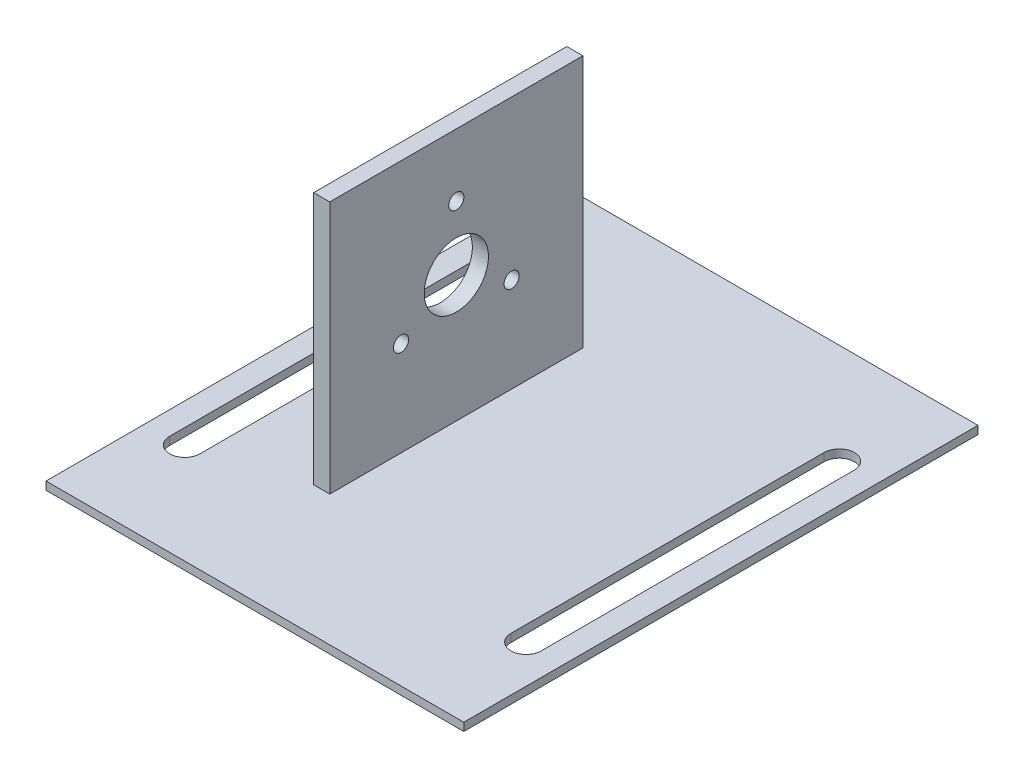
ISO-10303-21;
HEADER;
FILE_DESCRIPTION(('STEP AP214'),'2;1');
FILE_NAME('part.step','',(''),(''),'','','');
FILE_SCHEMA(('AUTOMOTIVE_DESIGN { 1 0 10303 214 1 1 1 1 }'));
ENDSEC;
DATA;
#1=APPLICATION_CONTEXT('core data for automotive mechanical design processes');
#2=APPLICATION_PROTOCOL_DEFINITION('international standard','automotive_design',2000,#1);
#3=PRODUCT_CONTEXT('',#1,'mechanical');
#4=PRODUCT('Part','Part','',(#3));
#5=PRODUCT_RELATED_PRODUCT_CATEGORY('part','',(#4));
#6=PRODUCT_DEFINITION_FORMATION('','',#4);
#7=PRODUCT_DEFINITION_CONTEXT('part definition',#1,'design');
#8=PRODUCT_DEFINITION('design','',#6,#7);
#9=PRODUCT_DEFINITION_SHAPE('','',#8);
#10=(LENGTH_UNIT() NAMED_UNIT(*) SI_UNIT(.MILLI.,.METRE.));
#11=(NAMED_UNIT(*) PLANE_ANGLE_UNIT() SI_UNIT($,.RADIAN.));
#12=(NAMED_UNIT(*) SI_UNIT($,.STERADIAN.) SOLID_ANGLE_UNIT());
#13=UNCERTAINTY_MEASURE_WITH_UNIT(LENGTH_MEASURE(1.E-05),#10,'distance_accuracy_value','');
#14=(GEOMETRIC_REPRESENTATION_CONTEXT(3) GLOBAL_UNCERTAINTY_ASSIGNED_CONTEXT((#13)) GLOBAL_UNIT_ASSIGNED_CONTEXT((#10,
#11,#12)) REPRESENTATION_CONTEXT('',''));
#15=CARTESIAN_POINT('',(0.,0.,0.));
#16=DIRECTION('',(0.,0.,1.));
#17=DIRECTION('',(1.,0.,0.));
#18=AXIS2_PLACEMENT_3D('',#15,#16,#17);
#19=CARTESIAN_POINT('',(0.,3.17500000000009,-203.200000000001));
#20=DIRECTION('',(0.,-1.,0.));
#21=DIRECTION('',(0.,0.,-1.));
#22=AXIS2_PLACEMENT_3D('',#19,#20,#21);
#23=PLANE('',#22);
#24=DIRECTION('',(0.,0.,1.));
#25=VECTOR('',#24,1.);
#26=CARTESIAN_POINT('',(0.,3.175,0.));
#27=LINE('',#26,#25);
#28=CARTESIAN_POINT('',(0.,3.17500000000009,-203.200000000001));
#29=VERTEX_POINT('',#28);
#30=CARTESIAN_POINT('',(0.,3.175,0.));
#31=VERTEX_POINT('',#30);
#32=EDGE_CURVE('E241',#29,#31,#27,.T.);
#33=ORIENTED_EDGE('',*,*,#32,.T.);
#34=DIRECTION('',(1.,0.,0.));
#35=VECTOR('',#34,1.);
#36=CARTESIAN_POINT('',(0.,3.175,0.));
#37=LINE('',#36,#35);
#38=CARTESIAN_POINT('',(165.1,3.17499999999982,0.));
#39=VERTEX_POINT('',#38);
#40=EDGE_CURVE('E244',#31,#39,#37,.T.);
#41=ORIENTED_EDGE('',*,*,#40,.T.);
#42=DIRECTION('',(0.,0.,-1.));
#43=VECTOR('',#42,1.);
#44=CARTESIAN_POINT('',(165.1,3.17499999999982,0.));
#45=LINE('',#44,#43);
#46=CARTESIAN_POINT('',(165.1,3.17499999999991,-203.200000000001));
#47=VERTEX_POINT('',#46);
#48=EDGE_CURVE('E247',#39,#47,#45,.T.);
#49=ORIENTED_EDGE('',*,*,#48,.T.);
#50=DIRECTION('',(-1.,0.,0.));
#51=VECTOR('',#50,1.);
#52=CARTESIAN_POINT('',(0.,3.17500000000009,-203.200000000001));
#53=LINE('',#52,#51);
#54=EDGE_CURVE('E249',#47,#29,#53,.T.);
#55=ORIENTED_EDGE('',*,*,#54,.T.);
#56=EDGE_LOOP('',(#33,#41,#49,#55));
#57=FACE_BOUND('',#56,.T.);
#58=DIRECTION('',(0.,0.,-1.));
#59=VECTOR('',#58,1.);
#60=CARTESIAN_POINT('',(21.113,3.17500000000009,-39.7388543084864));
#61=LINE('',#60,#59);
#62=CARTESIAN_POINT('',(21.113,3.17500000000009,-39.7388543084864));
#63=VERTEX_POINT('',#62);
#64=CARTESIAN_POINT('',(21.113,3.17500000000011,-163.461145691515));
#65=VERTEX_POINT('',#64);
#66=EDGE_CURVE('E224',#63,#65,#61,.T.);
#67=ORIENTED_EDGE('',*,*,#66,.F.);
#68=CARTESIAN_POINT('',(15.113,3.17500000000009,-39.7388543084864));
#69=DIRECTION('',(0.,1.,0.));
#70=DIRECTION('',(0.,0.,1.));
#71=AXIS2_PLACEMENT_3D('',#68,#69,#70);
#72=CIRCLE('',#71,5.99999999999998);
#73=CARTESIAN_POINT('',(9.11300000000007,3.17500000000009,-39.7388543084864));
#74=VERTEX_POINT('',#73);
#75=EDGE_CURVE('E202',#74,#63,#72,.T.);
#76=ORIENTED_EDGE('',*,*,#75,.F.);
#77=DIRECTION('',(0.,0.,1.));
#78=VECTOR('',#77,1.);
#79=CARTESIAN_POINT('',(9.11300000000007,3.17500000000009,-39.7388543084864));
#80=LINE('',#79,#78);
#81=CARTESIAN_POINT('',(9.11300000000004,3.17500000000011,-163.461145691515));
#82=VERTEX_POINT('',#81);
#83=EDGE_CURVE('E213',#82,#74,#80,.T.);
#84=ORIENTED_EDGE('',*,*,#83,.F.);
#85=CARTESIAN_POINT('',(15.113,3.17500000000011,-163.461145691515));
#86=DIRECTION('',(0.,1.,0.));
#87=DIRECTION('',(0.,0.,1.));
#88=AXIS2_PLACEMENT_3D('',#85,#86,#87);
#89=CIRCLE('',#88,5.99999999999998);
#90=EDGE_CURVE('E227',#65,#82,#89,.T.);
#91=ORIENTED_EDGE('',*,*,#90,.F.);
#92=EDGE_LOOP('',(#67,#76,#84,#91));
#93=FACE_BOUND('',#92,.T.);
#94=DIRECTION('',(0.,0.,-1.));
#95=VECTOR('',#94,1.);
#96=CARTESIAN_POINT('',(155.987,3.1749999999999,-39.7388543084864));
#97=LINE('',#96,#95);
#98=CARTESIAN_POINT('',(155.987,3.1749999999999,-39.7388543084864));
#99=VERTEX_POINT('',#98);
#100=CARTESIAN_POINT('',(155.987,3.175,-163.461145691514));
#101=VERTEX_POINT('',#100);
#102=EDGE_CURVE('E173',#99,#101,#97,.T.);
#103=ORIENTED_EDGE('',*,*,#102,.F.);
#104=CARTESIAN_POINT('',(149.987,3.1749999999999,-39.7388543084864));
#105=DIRECTION('',(0.,1.,0.));
#106=DIRECTION('',(0.,0.,1.));
#107=AXIS2_PLACEMENT_3D('',#104,#105,#106);
#108=CIRCLE('',#107,6.00000000000002);
#109=CARTESIAN_POINT('',(143.987,3.1749999999999,-39.7388543084864));
#110=VERTEX_POINT('',#109);
#111=EDGE_CURVE('E171',#110,#99,#108,.T.);
#112=ORIENTED_EDGE('',*,*,#111,.F.);
#113=DIRECTION('',(0.,0.,1.));
#114=VECTOR('',#113,1.);
#115=CARTESIAN_POINT('',(143.987,3.1749999999999,-39.7388543084864));
#116=LINE('',#115,#114);
#117=CARTESIAN_POINT('',(143.987,3.175,-163.461145691514));
#118=VERTEX_POINT('',#117);
#119=EDGE_CURVE('E183',#118,#110,#116,.T.);
#120=ORIENTED_EDGE('',*,*,#119,.F.);
#121=CARTESIAN_POINT('',(149.987,3.175,-163.461145691514));
#122=DIRECTION('',(0.,1.,0.));
#123=DIRECTION('',(0.,0.,1.));
#124=AXIS2_PLACEMENT_3D('',#121,#122,#123);
#125=CIRCLE('',#124,6.00000000000002);
#126=EDGE_CURVE('E195',#101,#118,#125,.T.);
#127=ORIENTED_EDGE('',*,*,#126,.F.);
#128=EDGE_LOOP('',(#103,#112,#120,#127));
#129=FACE_BOUND('',#128,.T.);
#130=DIRECTION('',(0.,0.,-1.));
#131=VECTOR('',#130,1.);
#132=CARTESIAN_POINT('',(60.5496528085068,3.175,-51.6000000000002));
#133=LINE('',#132,#131);
#134=CARTESIAN_POINT('',(60.5496528085068,3.175,-51.6000000000002));
#135=VERTEX_POINT('',#134);
#136=CARTESIAN_POINT('',(60.549652808507,3.175,-151.600000000001));
#137=VERTEX_POINT('',#136);
#138=EDGE_CURVE('E170',#135,#137,#133,.T.);
#139=ORIENTED_EDGE('',*,*,#138,.F.);
#140=DIRECTION('',(1.,0.,0.));
#141=VECTOR('',#140,1.);
#142=CARTESIAN_POINT('',(54.1996528085068,3.175,-51.6000000000002));
#143=LINE('',#142,#141);
#144=CARTESIAN_POINT('',(54.1996528085068,3.175,-51.6000000000002));
#145=VERTEX_POINT('',#144);
#146=EDGE_CURVE('E167',#145,#135,#143,.T.);
#147=ORIENTED_EDGE('',*,*,#146,.F.);
#148=DIRECTION('',(0.,0.,1.));
#149=VECTOR('',#148,1.);
#150=CARTESIAN_POINT('',(54.1996528085068,3.175,-51.6000000000002));
#151=LINE('',#150,#149);
#152=CARTESIAN_POINT('',(54.199652808507,3.175,-151.600000000001));
#153=VERTEX_POINT('',#152);
#154=EDGE_CURVE('E57',#153,#145,#151,.T.);
#155=ORIENTED_EDGE('',*,*,#154,.F.);
#156=DIRECTION('',(-1.,0.,0.));
#157=VECTOR('',#156,1.);
#158=CARTESIAN_POINT('',(54.199652808507,3.175,-151.600000000001));
#159=LINE('',#158,#157);
#160=EDGE_CURVE('E52',#137,#153,#159,.T.);
#161=ORIENTED_EDGE('',*,*,#160,.F.);
#162=EDGE_LOOP('',(#139,#147,#155,#161));
#163=FACE_BOUND('',#162,.T.);
#164=ADVANCED_FACE('F35',(#57,#93,#129,#163),#23,.F.);
#165=CARTESIAN_POINT('',(0.,3.175,0.));
#166=DIRECTION('',(1.,0.,0.));
#167=DIRECTION('',(0.,0.,-1.));
#168=AXIS2_PLACEMENT_3D('',#165,#166,#167);
#169=PLANE('',#168);
#170=DIRECTION('',(0.,0.,1.));
#171=VECTOR('',#170,1.);
#172=CARTESIAN_POINT('',(0.,0.,0.));
#173=LINE('',#172,#171);
#174=CARTESIAN_POINT('',(0.,0.,-203.200000000001));
#175=VERTEX_POINT('',#174);
#176=CARTESIAN_POINT('',(0.,0.,0.));
#177=VERTEX_POINT('',#176);
#178=EDGE_CURVE('E234',#175,#177,#173,.T.);
#179=ORIENTED_EDGE('',*,*,#178,.T.);
#180=DIRECTION('',(0.,-1.,0.));
#181=VECTOR('',#180,1.);
#182=CARTESIAN_POINT('',(0.,3.175,0.));
#183=LINE('',#182,#181);
#184=EDGE_CURVE('E11',#31,#177,#183,.T.);
#185=ORIENTED_EDGE('',*,*,#184,.F.);
#186=ORIENTED_EDGE('',*,*,#32,.F.);
#187=DIRECTION('',(0.,-1.,0.));
#188=VECTOR('',#187,1.);
#189=CARTESIAN_POINT('',(0.,3.17500000000009,-203.200000000001));
#190=LINE('',#189,#188);
#191=EDGE_CURVE('E251',#29,#175,#190,.T.);
#192=ORIENTED_EDGE('',*,*,#191,.T.);
#193=EDGE_LOOP('',(#179,#185,#186,#192));
#194=FACE_BOUND('',#193,.T.);
#195=ADVANCED_FACE('F37',(#194),#169,.F.);
#196=CARTESIAN_POINT('',(0.,3.175,0.));
#197=DIRECTION('',(0.,0.,-1.));
#198=DIRECTION('',(-1.,0.,0.));
#199=AXIS2_PLACEMENT_3D('',#196,#197,#198);
#200=PLANE('',#199);
#201=DIRECTION('',(1.,0.,0.));
#202=VECTOR('',#201,1.);
#203=CARTESIAN_POINT('',(0.,0.,0.));
#204=LINE('',#203,#202);
#205=CARTESIAN_POINT('',(165.1,-1.94289029309402E-13,0.));
#206=VERTEX_POINT('',#205);
#207=EDGE_CURVE('E254',#177,#206,#204,.T.);
#208=ORIENTED_EDGE('',*,*,#207,.T.);
#209=DIRECTION('',(0.,-1.,0.));
#210=VECTOR('',#209,1.);
#211=CARTESIAN_POINT('',(165.1,3.17499999999982,0.));
#212=LINE('',#211,#210);
#213=EDGE_CURVE('E44',#39,#206,#212,.T.);
#214=ORIENTED_EDGE('',*,*,#213,.F.);
#215=ORIENTED_EDGE('',*,*,#40,.F.);
#216=ORIENTED_EDGE('',*,*,#184,.T.);
#217=EDGE_LOOP('',(#208,#214,#215,#216));
#218=FACE_BOUND('',#217,.T.);
#219=ADVANCED_FACE('F319',(#218),#200,.F.);
#220=CARTESIAN_POINT('',(165.1,3.17499999999982,0.));
#221=DIRECTION('',(-1.,0.,0.));
#222=DIRECTION('',(0.,0.,1.));
#223=AXIS2_PLACEMENT_3D('',#220,#221,#222);
#224=PLANE('',#223);
#225=DIRECTION('',(0.,0.,-1.));
#226=VECTOR('',#225,1.);
#227=CARTESIAN_POINT('',(165.1,-1.94289029309402E-13,0.));
#228=LINE('',#227,#226);
#229=CARTESIAN_POINT('',(165.1,0.,-203.200000000001));
#230=VERTEX_POINT('',#229);
#231=EDGE_CURVE('E256',#206,#230,#228,.T.);
#232=ORIENTED_EDGE('',*,*,#231,.T.);
#233=DIRECTION('',(0.,-1.,0.));
#234=VECTOR('',#233,1.);
#235=CARTESIAN_POINT('',(165.1,3.17499999999991,-203.200000000001));
#236=LINE('',#235,#234);
#237=EDGE_CURVE('E261',#47,#230,#236,.T.);
#238=ORIENTED_EDGE('',*,*,#237,.F.);
#239=ORIENTED_EDGE('',*,*,#48,.F.);
#240=ORIENTED_EDGE('',*,*,#213,.T.);
#241=EDGE_LOOP('',(#232,#238,#239,#240));
#242=FACE_BOUND('',#241,.T.);
#243=ADVANCED_FACE('F333',(#242),#224,.F.);
#244=CARTESIAN_POINT('',(0.,3.17500000000009,-203.200000000001));
#245=DIRECTION('',(0.,0.,1.));
#246=DIRECTION('',(1.,0.,0.));
#247=AXIS2_PLACEMENT_3D('',#244,#245,#246);
#248=PLANE('',#247);
#249=DIRECTION('',(-1.,0.,0.));
#250=VECTOR('',#249,1.);
#251=CARTESIAN_POINT('',(0.,0.,-203.200000000001));
#252=LINE('',#251,#250);
#253=EDGE_CURVE('E245',#230,#175,#252,.T.);
#254=ORIENTED_EDGE('',*,*,#253,.T.);
#255=ORIENTED_EDGE('',*,*,#191,.F.);
#256=ORIENTED_EDGE('',*,*,#54,.F.);
#257=ORIENTED_EDGE('',*,*,#237,.T.);
#258=EDGE_LOOP('',(#254,#255,#256,#257));
#259=FACE_BOUND('',#258,.T.);
#260=ADVANCED_FACE('F329',(#259),#248,.F.);
#261=CARTESIAN_POINT('',(0.,0.,-203.200000000001));
#262=DIRECTION('',(0.,-1.,0.));
#263=DIRECTION('',(0.,0.,-1.));
#264=AXIS2_PLACEMENT_3D('',#261,#262,#263);
#265=PLANE('',#264);
#266=CARTESIAN_POINT('',(149.987,0.,-39.7388543084864));
#267=DIRECTION('',(0.,1.,0.));
#268=DIRECTION('',(0.,0.,1.));
#269=AXIS2_PLACEMENT_3D('',#266,#267,#268);
#270=CIRCLE('',#269,6.00000000000002);
#271=CARTESIAN_POINT('',(143.987,0.,-39.7388543084864));
#272=VERTEX_POINT('',#271);
#273=CARTESIAN_POINT('',(155.987,0.,-39.7388543084864));
#274=VERTEX_POINT('',#273);
#275=EDGE_CURVE('E179',#272,#274,#270,.T.);
#276=ORIENTED_EDGE('',*,*,#275,.T.);
#277=DIRECTION('',(0.,0.,-1.));
#278=VECTOR('',#277,1.);
#279=CARTESIAN_POINT('',(155.987,0.,-39.7388543084864));
#280=LINE('',#279,#278);
#281=CARTESIAN_POINT('',(155.987,0.,-163.461145691514));
#282=VERTEX_POINT('',#281);
#283=EDGE_CURVE('E182',#274,#282,#280,.T.);
#284=ORIENTED_EDGE('',*,*,#283,.T.);
#285=CARTESIAN_POINT('',(149.987,0.,-163.461145691514));
#286=DIRECTION('',(0.,1.,0.));
#287=DIRECTION('',(0.,0.,1.));
#288=AXIS2_PLACEMENT_3D('',#285,#286,#287);
#289=CIRCLE('',#288,6.00000000000002);
#290=CARTESIAN_POINT('',(143.987,0.,-163.461145691514));
#291=VERTEX_POINT('',#290);
#292=EDGE_CURVE('E186',#282,#291,#289,.T.);
#293=ORIENTED_EDGE('',*,*,#292,.T.);
#294=DIRECTION('',(0.,0.,1.));
#295=VECTOR('',#294,1.);
#296=CARTESIAN_POINT('',(143.987,0.,-39.7388543084864));
#297=LINE('',#296,#295);
#298=EDGE_CURVE('E189',#291,#272,#297,.T.);
#299=ORIENTED_EDGE('',*,*,#298,.T.);
#300=EDGE_LOOP('',(#276,#284,#293,#299));
#301=FACE_BOUND('',#300,.T.);
#302=CARTESIAN_POINT('',(15.113,0.,-39.7388543084864));
#303=DIRECTION('',(0.,1.,0.));
#304=DIRECTION('',(0.,0.,1.));
#305=AXIS2_PLACEMENT_3D('',#302,#303,#304);
#306=CIRCLE('',#305,5.99999999999998);
#307=CARTESIAN_POINT('',(9.11300000000007,0.,-39.7388543084864));
#308=VERTEX_POINT('',#307);
#309=CARTESIAN_POINT('',(21.113,0.,-39.7388543084864));
#310=VERTEX_POINT('',#309);
#311=EDGE_CURVE('E209',#308,#310,#306,.T.);
#312=ORIENTED_EDGE('',*,*,#311,.T.);
#313=DIRECTION('',(0.,0.,-1.));
#314=VECTOR('',#313,1.);
#315=CARTESIAN_POINT('',(21.113,0.,-39.7388543084864));
#316=LINE('',#315,#314);
#317=CARTESIAN_POINT('',(21.113,0.,-163.461145691515));
#318=VERTEX_POINT('',#317);
#319=EDGE_CURVE('E212',#310,#318,#316,.T.);
#320=ORIENTED_EDGE('',*,*,#319,.T.);
#321=CARTESIAN_POINT('',(15.113,0.,-163.461145691515));
#322=DIRECTION('',(0.,1.,0.));
#323=DIRECTION('',(0.,0.,1.));
#324=AXIS2_PLACEMENT_3D('',#321,#322,#323);
#325=CIRCLE('',#324,5.99999999999998);
#326=CARTESIAN_POINT('',(9.11300000000004,0.,-163.461145691515));
#327=VERTEX_POINT('',#326);
#328=EDGE_CURVE('E216',#318,#327,#325,.T.);
#329=ORIENTED_EDGE('',*,*,#328,.T.);
#330=DIRECTION('',(0.,0.,1.));
#331=VECTOR('',#330,1.);
#332=CARTESIAN_POINT('',(9.11300000000007,0.,-39.7388543084864));
#333=LINE('',#332,#331);
#334=EDGE_CURVE('E219',#327,#308,#333,.T.);
#335=ORIENTED_EDGE('',*,*,#334,.T.);
#336=EDGE_LOOP('',(#312,#320,#329,#335));
#337=FACE_BOUND('',#336,.T.);
#338=ORIENTED_EDGE('',*,*,#178,.F.);
#339=ORIENTED_EDGE('',*,*,#253,.F.);
#340=ORIENTED_EDGE('',*,*,#231,.F.);
#341=ORIENTED_EDGE('',*,*,#207,.F.);
#342=EDGE_LOOP('',(#338,#339,#340,#341));
#343=FACE_BOUND('',#342,.T.);
#344=ADVANCED_FACE('F326',(#301,#337,#343),#265,.T.);
#345=CARTESIAN_POINT('',(15.113,0.,-39.7388543084864));
#346=DIRECTION('',(0.,1.,0.));
#347=DIRECTION('',(0.,0.,1.));
#348=AXIS2_PLACEMENT_3D('',#345,#346,#347);
#349=CYLINDRICAL_SURFACE('',#348,5.99999999999998);
#350=ORIENTED_EDGE('',*,*,#75,.T.);
#351=DIRECTION('',(0.,1.,0.));
#352=VECTOR('',#351,1.);
#353=CARTESIAN_POINT('',(21.113,0.,-39.7388543084864));
#354=LINE('',#353,#352);
#355=EDGE_CURVE('E222',#310,#63,#354,.T.);
#356=ORIENTED_EDGE('',*,*,#355,.F.);
#357=ORIENTED_EDGE('',*,*,#311,.F.);
#358=DIRECTION('',(0.,1.,0.));
#359=VECTOR('',#358,1.);
#360=CARTESIAN_POINT('',(9.11300000000007,0.,-39.7388543084864));
#361=LINE('',#360,#359);
#362=EDGE_CURVE('E232',#308,#74,#361,.T.);
#363=ORIENTED_EDGE('',*,*,#362,.T.);
#364=EDGE_LOOP('',(#350,#356,#357,#363));
#365=FACE_BOUND('',#364,.T.);
#366=ADVANCED_FACE('F324',(#365),#349,.F.);
#367=CARTESIAN_POINT('',(9.11300000000007,0.,-39.7388543084864));
#368=DIRECTION('',(-1.,0.,0.));
#369=DIRECTION('',(0.,0.,1.));
#370=AXIS2_PLACEMENT_3D('',#367,#368,#369);
#371=PLANE('',#370);
#372=ORIENTED_EDGE('',*,*,#83,.T.);
#373=ORIENTED_EDGE('',*,*,#362,.F.);
#374=ORIENTED_EDGE('',*,*,#334,.F.);
#375=DIRECTION('',(0.,1.,0.));
#376=VECTOR('',#375,1.);
#377=CARTESIAN_POINT('',(9.11300000000004,0.,-163.461145691515));
#378=LINE('',#377,#376);
#379=EDGE_CURVE('E235',#327,#82,#378,.T.);
#380=ORIENTED_EDGE('',*,*,#379,.T.);
#381=EDGE_LOOP('',(#372,#373,#374,#380));
#382=FACE_BOUND('',#381,.T.);
#383=ADVANCED_FACE('F372',(#382),#371,.F.);
#384=CARTESIAN_POINT('',(15.113,0.,-163.461145691515));
#385=DIRECTION('',(0.,1.,0.));
#386=DIRECTION('',(0.,0.,1.));
#387=AXIS2_PLACEMENT_3D('',#384,#385,#386);
#388=CYLINDRICAL_SURFACE('',#387,5.99999999999998);
#389=ORIENTED_EDGE('',*,*,#90,.T.);
#390=ORIENTED_EDGE('',*,*,#379,.F.);
#391=ORIENTED_EDGE('',*,*,#328,.F.);
#392=DIRECTION('',(0.,1.,0.));
#393=VECTOR('',#392,1.);
#394=CARTESIAN_POINT('',(21.113,0.,-163.461145691515));
#395=LINE('',#394,#393);
#396=EDGE_CURVE('E237',#318,#65,#395,.T.);
#397=ORIENTED_EDGE('',*,*,#396,.T.);
#398=EDGE_LOOP('',(#389,#390,#391,#397));
#399=FACE_BOUND('',#398,.T.);
#400=ADVANCED_FACE('F379',(#399),#388,.F.);
#401=CARTESIAN_POINT('',(21.113,0.,-39.7388543084864));
#402=DIRECTION('',(1.,0.,0.));
#403=DIRECTION('',(0.,0.,-1.));
#404=AXIS2_PLACEMENT_3D('',#401,#402,#403);
#405=PLANE('',#404);
#406=ORIENTED_EDGE('',*,*,#66,.T.);
#407=ORIENTED_EDGE('',*,*,#396,.F.);
#408=ORIENTED_EDGE('',*,*,#319,.F.);
#409=ORIENTED_EDGE('',*,*,#355,.T.);
#410=EDGE_LOOP('',(#406,#407,#408,#409));
#411=FACE_BOUND('',#410,.T.);
#412=ADVANCED_FACE('F387',(#411),#405,.F.);
#413=CARTESIAN_POINT('',(149.987,0.,-39.7388543084864));
#414=DIRECTION('',(0.,1.,0.));
#415=DIRECTION('',(0.,0.,1.));
#416=AXIS2_PLACEMENT_3D('',#413,#414,#415);
#417=CYLINDRICAL_SURFACE('',#416,6.00000000000002);
#418=ORIENTED_EDGE('',*,*,#111,.T.);
#419=DIRECTION('',(0.,1.,0.));
#420=VECTOR('',#419,1.);
#421=CARTESIAN_POINT('',(155.987,0.,-39.7388543084864));
#422=LINE('',#421,#420);
#423=EDGE_CURVE('E191',#274,#99,#422,.T.);
#424=ORIENTED_EDGE('',*,*,#423,.F.);
#425=ORIENTED_EDGE('',*,*,#275,.F.);
#426=DIRECTION('',(0.,1.,0.));
#427=VECTOR('',#426,1.);
#428=CARTESIAN_POINT('',(143.987,0.,-39.7388543084864));
#429=LINE('',#428,#427);
#430=EDGE_CURVE('E200',#272,#110,#429,.T.);
#431=ORIENTED_EDGE('',*,*,#430,.T.);
#432=EDGE_LOOP('',(#418,#424,#425,#431));
#433=FACE_BOUND('',#432,.T.);
#434=ADVANCED_FACE('F395',(#433),#417,.F.);
#435=CARTESIAN_POINT('',(143.987,0.,-39.7388543084864));
#436=DIRECTION('',(-1.,0.,0.));
#437=DIRECTION('',(0.,0.,1.));
#438=AXIS2_PLACEMENT_3D('',#435,#436,#437);
#439=PLANE('',#438);
#440=ORIENTED_EDGE('',*,*,#119,.T.);
#441=ORIENTED_EDGE('',*,*,#430,.F.);
#442=ORIENTED_EDGE('',*,*,#298,.F.);
#443=DIRECTION('',(0.,1.,0.));
#444=VECTOR('',#443,1.);
#445=CARTESIAN_POINT('',(143.987,0.,-163.461145691514));
#446=LINE('',#445,#444);
#447=EDGE_CURVE('E203',#291,#118,#446,.T.);
#448=ORIENTED_EDGE('',*,*,#447,.T.);
#449=EDGE_LOOP('',(#440,#441,#442,#448));
#450=FACE_BOUND('',#449,.T.);
#451=ADVANCED_FACE('F402',(#450),#439,.F.);
#452=CARTESIAN_POINT('',(149.987,0.,-163.461145691514));
#453=DIRECTION('',(0.,1.,0.));
#454=DIRECTION('',(0.,0.,1.));
#455=AXIS2_PLACEMENT_3D('',#452,#453,#454);
#456=CYLINDRICAL_SURFACE('',#455,6.00000000000002);
#457=ORIENTED_EDGE('',*,*,#126,.T.);
#458=ORIENTED_EDGE('',*,*,#447,.F.);
#459=ORIENTED_EDGE('',*,*,#292,.F.);
#460=DIRECTION('',(0.,1.,0.));
#461=VECTOR('',#460,1.);
#462=CARTESIAN_POINT('',(155.987,0.,-163.461145691514));
#463=LINE('',#462,#461);
#464=EDGE_CURVE('E205',#282,#101,#463,.T.);
#465=ORIENTED_EDGE('',*,*,#464,.T.);
#466=EDGE_LOOP('',(#457,#458,#459,#465));
#467=FACE_BOUND('',#466,.T.);
#468=ADVANCED_FACE('F410',(#467),#456,.F.);
#469=CARTESIAN_POINT('',(155.987,0.,-39.7388543084864));
#470=DIRECTION('',(1.,0.,0.));
#471=DIRECTION('',(0.,0.,-1.));
#472=AXIS2_PLACEMENT_3D('',#469,#470,#471);
#473=PLANE('',#472);
#474=ORIENTED_EDGE('',*,*,#102,.T.);
#475=ORIENTED_EDGE('',*,*,#464,.F.);
#476=ORIENTED_EDGE('',*,*,#283,.F.);
#477=ORIENTED_EDGE('',*,*,#423,.T.);
#478=EDGE_LOOP('',(#474,#475,#476,#477));
#479=FACE_BOUND('',#478,.T.);
#480=ADVANCED_FACE('F418',(#479),#473,.F.);
#481=CARTESIAN_POINT('',(60.5496528085068,103.175,-51.6000000000004));
#482=DIRECTION('',(-1.,0.,0.));
#483=DIRECTION('',(0.,0.,1.));
#484=AXIS2_PLACEMENT_3D('',#481,#482,#483);
#485=PLANE('',#484);
#486=CARTESIAN_POINT('',(60.5496528085068,53.175,-101.6));
#487=DIRECTION('',(1.,0.,0.));
#488=DIRECTION('',(0.,0.,-1.));
#489=AXIS2_PLACEMENT_3D('',#486,#487,#488);
#490=CIRCLE('',#489,12.7);
#491=CARTESIAN_POINT('',(60.5496528085068,53.175,-114.3));
#492=VERTEX_POINT('',#491);
#493=EDGE_CURVE('E285',#492,#492,#490,.T.);
#494=ORIENTED_EDGE('',*,*,#493,.F.);
#495=EDGE_LOOP('',(#494));
#496=FACE_BOUND('',#495,.T.);
#497=CARTESIAN_POINT('',(60.5496528085068,78.3982785603564,-101.6));
#498=DIRECTION('',(1.,0.,0.));
#499=DIRECTION('',(0.,0.,-1.));
#500=AXIS2_PLACEMENT_3D('',#497,#498,#499);
#501=CIRCLE('',#500,2.99999999999999);
#502=CARTESIAN_POINT('',(60.5496528085068,78.3982785603564,-104.6));
#503=VERTEX_POINT('',#502);
#504=EDGE_CURVE('E275',#503,#503,#501,.T.);
#505=ORIENTED_EDGE('',*,*,#504,.F.);
#506=EDGE_LOOP('',(#505));
#507=FACE_BOUND('',#506,.T.);
#508=CARTESIAN_POINT('',(60.5496528085068,40.5633607198218,-79.7560000000004));
#509=DIRECTION('',(1.,0.,0.));
#510=DIRECTION('',(0.,0.,-1.));
#511=AXIS2_PLACEMENT_3D('',#508,#509,#510);
#512=CIRCLE('',#511,2.99999999999999);
#513=CARTESIAN_POINT('',(60.5496528085068,40.5633607198218,-82.7560000000004));
#514=VERTEX_POINT('',#513);
#515=EDGE_CURVE('E272',#514,#514,#512,.T.);
#516=ORIENTED_EDGE('',*,*,#515,.F.);
#517=EDGE_LOOP('',(#516));
#518=FACE_BOUND('',#517,.T.);
#519=CARTESIAN_POINT('',(60.5496528085068,40.5633607198219,-123.444000000001));
#520=DIRECTION('',(1.,0.,0.));
#521=DIRECTION('',(0.,0.,-1.));
#522=AXIS2_PLACEMENT_3D('',#519,#520,#521);
#523=CIRCLE('',#522,2.99999999999999);
#524=CARTESIAN_POINT('',(60.5496528085068,40.5633607198219,-126.444000000001));
#525=VERTEX_POINT('',#524);
#526=EDGE_CURVE('E269',#525,#525,#523,.T.);
#527=ORIENTED_EDGE('',*,*,#526,.F.);
#528=EDGE_LOOP('',(#527));
#529=FACE_BOUND('',#528,.T.);
#530=ORIENTED_EDGE('',*,*,#138,.T.);
#531=DIRECTION('',(0.,-1.,0.));
#532=VECTOR('',#531,1.);
#533=CARTESIAN_POINT('',(60.5496528085068,103.175,-151.600000000001));
#534=LINE('',#533,#532);
#535=CARTESIAN_POINT('',(60.5496528085068,103.175,-151.600000000001));
#536=VERTEX_POINT('',#535);
#537=EDGE_CURVE('E151',#536,#137,#534,.T.);
#538=ORIENTED_EDGE('',*,*,#537,.F.);
#539=DIRECTION('',(0.,0.,-1.));
#540=VECTOR('',#539,1.);
#541=CARTESIAN_POINT('',(60.5496528085068,103.175,-51.6000000000004));
#542=LINE('',#541,#540);
#543=CARTESIAN_POINT('',(60.5496528085068,103.175,-51.6000000000004));
#544=VERTEX_POINT('',#543);
#545=EDGE_CURVE('E158',#544,#536,#542,.T.);
#546=ORIENTED_EDGE('',*,*,#545,.F.);
#547=DIRECTION('',(0.,-1.,0.));
#548=VECTOR('',#547,1.);
#549=CARTESIAN_POINT('',(60.5496528085068,103.175,-51.6000000000004));
#550=LINE('',#549,#548);
#551=EDGE_CURVE('E292',#544,#135,#550,.T.);
#552=ORIENTED_EDGE('',*,*,#551,.T.);
#553=EDGE_LOOP('',(#530,#538,#546,#552));
#554=FACE_BOUND('',#553,.T.);
#555=ADVANCED_FACE('F169',(#496,#507,#518,#529,#554),#485,.F.);
#556=CARTESIAN_POINT('',(54.1996528085068,103.175,-151.600000000001));
#557=DIRECTION('',(0.,0.,1.));
#558=DIRECTION('',(1.,0.,0.));
#559=AXIS2_PLACEMENT_3D('',#556,#557,#558);
#560=PLANE('',#559);
#561=ORIENTED_EDGE('',*,*,#160,.T.);
#562=DIRECTION('',(0.,-1.,0.));
#563=VECTOR('',#562,1.);
#564=CARTESIAN_POINT('',(54.1996528085068,103.175,-151.600000000001));
#565=LINE('',#564,#563);
#566=CARTESIAN_POINT('',(54.1996528085068,103.175,-151.600000000001));
#567=VERTEX_POINT('',#566);
#568=EDGE_CURVE('E154',#567,#153,#565,.T.);
#569=ORIENTED_EDGE('',*,*,#568,.F.);
#570=DIRECTION('',(-1.,0.,0.));
#571=VECTOR('',#570,1.);
#572=CARTESIAN_POINT('',(54.1996528085068,103.175,-151.600000000001));
#573=LINE('',#572,#571);
#574=EDGE_CURVE('E147',#536,#567,#573,.T.);
#575=ORIENTED_EDGE('',*,*,#574,.F.);
#576=ORIENTED_EDGE('',*,*,#537,.T.);
#577=EDGE_LOOP('',(#561,#569,#575,#576));
#578=FACE_BOUND('',#577,.T.);
#579=ADVANCED_FACE('F149',(#578),#560,.F.);
#580=CARTESIAN_POINT('',(54.1996528085068,103.175,-51.6000000000004));
#581=DIRECTION('',(1.,0.,0.));
#582=DIRECTION('',(0.,0.,-1.));
#583=AXIS2_PLACEMENT_3D('',#580,#581,#582);
#584=PLANE('',#583);
#585=CARTESIAN_POINT('',(54.1996528085069,53.175,-101.6));
#586=DIRECTION('',(1.,0.,0.));
#587=DIRECTION('',(0.,0.,-1.));
#588=AXIS2_PLACEMENT_3D('',#585,#586,#587);
#589=CIRCLE('',#588,12.7);
#590=CARTESIAN_POINT('',(54.1996528085069,53.175,-114.3));
#591=VERTEX_POINT('',#590);
#592=EDGE_CURVE('E39',#591,#591,#589,.T.);
#593=ORIENTED_EDGE('',*,*,#592,.T.);
#594=EDGE_LOOP('',(#593));
#595=FACE_BOUND('',#594,.T.);
#596=CARTESIAN_POINT('',(54.1996528085068,78.3982785603564,-101.6));
#597=DIRECTION('',(1.,0.,0.));
#598=DIRECTION('',(0.,0.,-1.));
#599=AXIS2_PLACEMENT_3D('',#596,#597,#598);
#600=CIRCLE('',#599,2.99999999999999);
#601=CARTESIAN_POINT('',(54.1996528085068,78.3982785603564,-104.6));
#602=VERTEX_POINT('',#601);
#603=EDGE_CURVE('E273',#602,#602,#600,.T.);
#604=ORIENTED_EDGE('',*,*,#603,.T.);
#605=EDGE_LOOP('',(#604));
#606=FACE_BOUND('',#605,.T.);
#607=CARTESIAN_POINT('',(54.1996528085068,40.5633607198218,-79.7560000000004));
#608=DIRECTION('',(1.,0.,0.));
#609=DIRECTION('',(0.,0.,-1.));
#610=AXIS2_PLACEMENT_3D('',#607,#608,#609);
#611=CIRCLE('',#610,2.99999999999999);
#612=CARTESIAN_POINT('',(54.1996528085068,40.5633607198218,-82.7560000000004));
#613=VERTEX_POINT('',#612);
#614=EDGE_CURVE('E270',#613,#613,#611,.T.);
#615=ORIENTED_EDGE('',*,*,#614,.T.);
#616=EDGE_LOOP('',(#615));
#617=FACE_BOUND('',#616,.T.);
#618=CARTESIAN_POINT('',(54.1996528085069,40.5633607198219,-123.444000000001));
#619=DIRECTION('',(1.,0.,0.));
#620=DIRECTION('',(0.,0.,-1.));
#621=AXIS2_PLACEMENT_3D('',#618,#619,#620);
#622=CIRCLE('',#621,2.99999999999999);
#623=CARTESIAN_POINT('',(54.1996528085069,40.5633607198219,-126.444000000001));
#624=VERTEX_POINT('',#623);
#625=EDGE_CURVE('E266',#624,#624,#622,.T.);
#626=ORIENTED_EDGE('',*,*,#625,.T.);
#627=EDGE_LOOP('',(#626));
#628=FACE_BOUND('',#627,.T.);
#629=ORIENTED_EDGE('',*,*,#154,.T.);
#630=DIRECTION('',(0.,-1.,0.));
#631=VECTOR('',#630,1.);
#632=CARTESIAN_POINT('',(54.1996528085068,103.175,-51.6000000000004));
#633=LINE('',#632,#631);
#634=CARTESIAN_POINT('',(54.1996528085068,103.175,-51.6000000000004));
#635=VERTEX_POINT('',#634);
#636=EDGE_CURVE('E175',#635,#145,#633,.T.);
#637=ORIENTED_EDGE('',*,*,#636,.F.);
#638=DIRECTION('',(0.,0.,1.));
#639=VECTOR('',#638,1.);
#640=CARTESIAN_POINT('',(54.1996528085068,103.175,-51.6000000000004));
#641=LINE('',#640,#639);
#642=EDGE_CURVE('E157',#567,#635,#641,.T.);
#643=ORIENTED_EDGE('',*,*,#642,.F.);
#644=ORIENTED_EDGE('',*,*,#568,.T.);
#645=EDGE_LOOP('',(#629,#637,#643,#644));
#646=FACE_BOUND('',#645,.T.);
#647=ADVANCED_FACE('F303',(#595,#606,#617,#628,#646),#584,.F.);
#648=CARTESIAN_POINT('',(54.1996528085068,103.175,-51.6000000000004));
#649=DIRECTION('',(0.,0.,-1.));
#650=DIRECTION('',(-1.,0.,0.));
#651=AXIS2_PLACEMENT_3D('',#648,#649,#650);
#652=PLANE('',#651);
#653=ORIENTED_EDGE('',*,*,#146,.T.);
#654=ORIENTED_EDGE('',*,*,#551,.F.);
#655=DIRECTION('',(1.,0.,0.));
#656=VECTOR('',#655,1.);
#657=CARTESIAN_POINT('',(54.1996528085068,103.175,-51.6000000000004));
#658=LINE('',#657,#656);
#659=EDGE_CURVE('E163',#635,#544,#658,.T.);
#660=ORIENTED_EDGE('',*,*,#659,.F.);
#661=ORIENTED_EDGE('',*,*,#636,.T.);
#662=EDGE_LOOP('',(#653,#654,#660,#661));
#663=FACE_BOUND('',#662,.T.);
#664=ADVANCED_FACE('F301',(#663),#652,.F.);
#665=CARTESIAN_POINT('',(60.5496528085068,103.175,-151.600000000001));
#666=DIRECTION('',(0.,-1.,0.));
#667=DIRECTION('',(0.,0.,-1.));
#668=AXIS2_PLACEMENT_3D('',#665,#666,#667);
#669=PLANE('',#668);
#670=ORIENTED_EDGE('',*,*,#545,.T.);
#671=ORIENTED_EDGE('',*,*,#574,.T.);
#672=ORIENTED_EDGE('',*,*,#642,.T.);
#673=ORIENTED_EDGE('',*,*,#659,.T.);
#674=EDGE_LOOP('',(#670,#671,#672,#673));
#675=FACE_BOUND('',#674,.T.);
#676=ADVANCED_FACE('F161',(#675),#669,.F.);
#677=CARTESIAN_POINT('',(60.5496528085068,40.5633607198219,-123.444000000001));
#678=DIRECTION('',(1.,0.,0.));
#679=DIRECTION('',(0.,0.,-1.));
#680=AXIS2_PLACEMENT_3D('',#677,#678,#679);
#681=CYLINDRICAL_SURFACE('',#680,2.99999999999999);
#682=ORIENTED_EDGE('',*,*,#526,.T.);
#683=EDGE_LOOP('',(#682));
#684=FACE_BOUND('',#683,.T.);
#685=ORIENTED_EDGE('',*,*,#625,.F.);
#686=EDGE_LOOP('',(#685));
#687=FACE_BOUND('',#686,.T.);
#688=ADVANCED_FACE('F451',(#684,#687),#681,.F.);
#689=CARTESIAN_POINT('',(60.5496528085068,40.5633607198218,-79.7560000000004));
#690=DIRECTION('',(1.,0.,0.));
#691=DIRECTION('',(0.,0.,-1.));
#692=AXIS2_PLACEMENT_3D('',#689,#690,#691);
#693=CYLINDRICAL_SURFACE('',#692,2.99999999999999);
#694=ORIENTED_EDGE('',*,*,#515,.T.);
#695=EDGE_LOOP('',(#694));
#696=FACE_BOUND('',#695,.T.);
#697=ORIENTED_EDGE('',*,*,#614,.F.);
#698=EDGE_LOOP('',(#697));
#699=FACE_BOUND('',#698,.T.);
#700=ADVANCED_FACE('F458',(#696,#699),#693,.F.);
#701=CARTESIAN_POINT('',(60.5496528085068,78.3982785603564,-101.6));
#702=DIRECTION('',(1.,0.,0.));
#703=DIRECTION('',(0.,0.,-1.));
#704=AXIS2_PLACEMENT_3D('',#701,#702,#703);
#705=CYLINDRICAL_SURFACE('',#704,2.99999999999999);
#706=ORIENTED_EDGE('',*,*,#504,.T.);
#707=EDGE_LOOP('',(#706));
#708=FACE_BOUND('',#707,.T.);
#709=ORIENTED_EDGE('',*,*,#603,.F.);
#710=EDGE_LOOP('',(#709));
#711=FACE_BOUND('',#710,.T.);
#712=ADVANCED_FACE('F466',(#708,#711),#705,.F.);
#713=CARTESIAN_POINT('',(0.,53.175,-101.6));
#714=DIRECTION('',(1.,0.,0.));
#715=DIRECTION('',(0.,0.,-1.));
#716=AXIS2_PLACEMENT_3D('',#713,#714,#715);
#717=CYLINDRICAL_SURFACE('',#716,12.7);
#718=ORIENTED_EDGE('',*,*,#493,.T.);
#719=EDGE_LOOP('',(#718));
#720=FACE_BOUND('',#719,.T.);
#721=ORIENTED_EDGE('',*,*,#592,.F.);
#722=EDGE_LOOP('',(#721));
#723=FACE_BOUND('',#722,.T.);
#724=ADVANCED_FACE('F474',(#720,#723),#717,.F.);
#725=CLOSED_SHELL('',(#164,#195,#219,#243,#260,#344,#366,#383,#400,#412,#434,#451,#468,#480,
#555,#579,#647,#664,#676,#688,#700,#712,#724));
#726=MANIFOLD_SOLID_BREP('B2',#725);
#727=ADVANCED_BREP_SHAPE_REPRESENTATION('',(#18,#726),#14);
#728=SHAPE_DEFINITION_REPRESENTATION(#9,#727);
ENDSEC;
END-ISO-10303-21;
